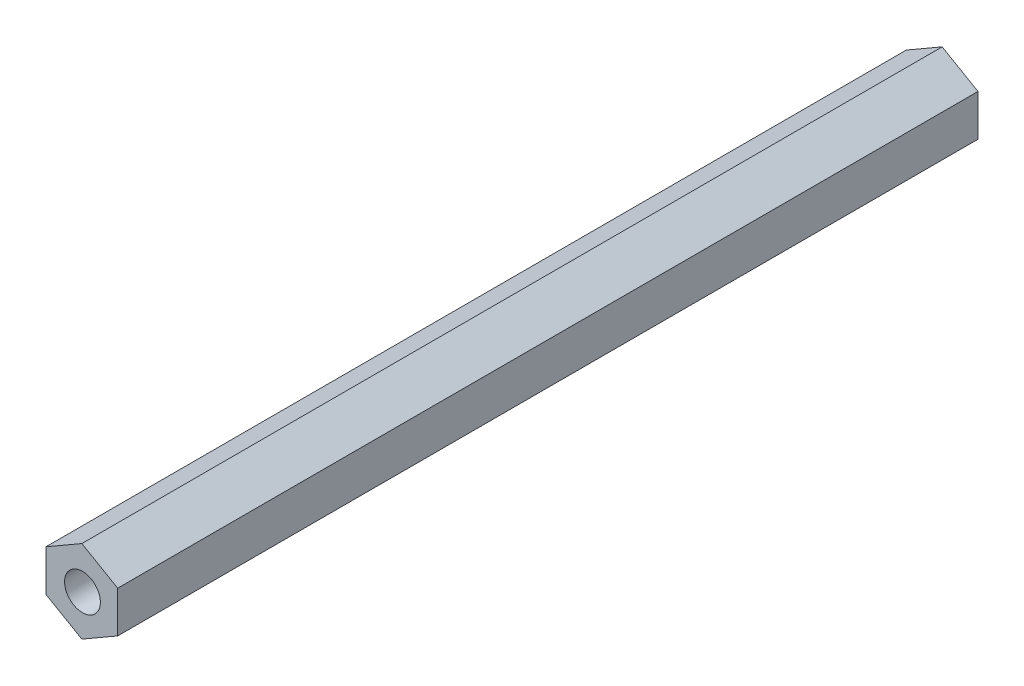
ISO-10303-21;
HEADER;
FILE_DESCRIPTION(('STEP AP214'),'2;1');
FILE_NAME('part.step','',(''),(''),'','','');
FILE_SCHEMA(('AUTOMOTIVE_DESIGN { 1 0 10303 214 1 1 1 1 }'));
ENDSEC;
DATA;
#1=APPLICATION_CONTEXT('core data for automotive mechanical design processes');
#2=APPLICATION_PROTOCOL_DEFINITION('international standard','automotive_design',2000,#1);
#3=PRODUCT_CONTEXT('',#1,'mechanical');
#4=PRODUCT('Part','Part','',(#3));
#5=PRODUCT_RELATED_PRODUCT_CATEGORY('part','',(#4));
#6=PRODUCT_DEFINITION_FORMATION('','',#4);
#7=PRODUCT_DEFINITION_CONTEXT('part definition',#1,'design');
#8=PRODUCT_DEFINITION('design','',#6,#7);
#9=PRODUCT_DEFINITION_SHAPE('','',#8);
#10=(LENGTH_UNIT() NAMED_UNIT(*) SI_UNIT(.MILLI.,.METRE.));
#11=(NAMED_UNIT(*) PLANE_ANGLE_UNIT() SI_UNIT($,.RADIAN.));
#12=(NAMED_UNIT(*) SI_UNIT($,.STERADIAN.) SOLID_ANGLE_UNIT());
#13=UNCERTAINTY_MEASURE_WITH_UNIT(LENGTH_MEASURE(1.E-05),#10,'distance_accuracy_value','');
#14=(GEOMETRIC_REPRESENTATION_CONTEXT(3) GLOBAL_UNCERTAINTY_ASSIGNED_CONTEXT((#13)) GLOBAL_UNIT_ASSIGNED_CONTEXT((#10,
#11,#12)) REPRESENTATION_CONTEXT('',''));
#15=CARTESIAN_POINT('',(0.,0.,0.));
#16=DIRECTION('',(0.,0.,1.));
#17=DIRECTION('',(1.,0.,0.));
#18=AXIS2_PLACEMENT_3D('',#15,#16,#17);
#19=CARTESIAN_POINT('',(0.0438845966641566,-0.0180420660313985,49.9999999998977));
#20=DIRECTION('',(0.,0.,1.));
#21=DIRECTION('',(0.,-1.,0.));
#22=AXIS2_PLACEMENT_3D('',#19,#20,#21);
#23=CONICAL_SURFACE('',#22,1.24999999985675,1.02974425836087);
#24=CARTESIAN_POINT('',(0.0438845966641566,-0.0180420660313985,50.));
#25=DIRECTION('',(0.,0.,-1.));
#26=DIRECTION('',(-1.,0.,0.));
#27=AXIS2_PLACEMENT_3D('',#24,#25,#26);
#28=CIRCLE('',#27,1.24999999999999);
#29=CARTESIAN_POINT('',(-1.20611540333584,-0.0180420660313985,50.));
#30=VERTEX_POINT('',#29);
#31=EDGE_CURVE('E126',#30,#30,#28,.F.);
#32=ORIENTED_EDGE('',*,*,#31,.T.);
#33=EDGE_LOOP('',(#32));
#34=FACE_BOUND('',#33,.T.);
#35=CARTESIAN_POINT('',(0.0438845969199519,-0.0180420660313985,49.2489242260774));
#36=VERTEX_POINT('',#35);
#37=VERTEX_LOOP('',#36);
#38=FACE_BOUND('',#37,.T.);
#39=ADVANCED_FACE('F15',(#34,#38),#23,.F.);
#40=CARTESIAN_POINT('',(0.0438845966641566,-0.0180420660313985,10.0000000000477));
#41=DIRECTION('',(0.,0.,-1.));
#42=DIRECTION('',(-1.,0.,0.));
#43=AXIS2_PLACEMENT_3D('',#40,#41,#42);
#44=CONICAL_SURFACE('',#43,1.24999999985675,1.02974425843443);
#45=CARTESIAN_POINT('',(0.0438845964367829,-0.0180420660313985,10.751075773868));
#46=VERTEX_POINT('',#45);
#47=VERTEX_LOOP('',#46);
#48=FACE_BOUND('',#47,.T.);
#49=CARTESIAN_POINT('',(0.0438845966641566,-0.0180420660313985,10.));
#50=DIRECTION('',(0.,0.,1.));
#51=DIRECTION('',(1.,0.,0.));
#52=AXIS2_PLACEMENT_3D('',#49,#50,#51);
#53=CIRCLE('',#52,1.24999999999999);
#54=CARTESIAN_POINT('',(1.29388459666415,-0.0180420660313985,10.));
#55=VERTEX_POINT('',#54);
#56=EDGE_CURVE('E149',#55,#55,#53,.F.);
#57=ORIENTED_EDGE('',*,*,#56,.T.);
#58=EDGE_LOOP('',(#57));
#59=FACE_BOUND('',#58,.T.);
#60=ADVANCED_FACE('F72',(#48,#59),#44,.F.);
#61=CARTESIAN_POINT('',(0.0438845966641566,-0.0180420660313985,60.));
#62=DIRECTION('',(0.,0.,-1.));
#63=DIRECTION('',(-1.,0.,0.));
#64=AXIS2_PLACEMENT_3D('',#61,#62,#63);
#65=CYLINDRICAL_SURFACE('',#64,1.24999999999999);
#66=ORIENTED_EDGE('',*,*,#31,.F.);
#67=EDGE_LOOP('',(#66));
#68=FACE_BOUND('',#67,.T.);
#69=CARTESIAN_POINT('',(0.0438845966641566,-0.0180420660313985,60.));
#70=DIRECTION('',(0.,0.,-1.));
#71=DIRECTION('',(-1.,0.,0.));
#72=AXIS2_PLACEMENT_3D('',#69,#70,#71);
#73=CIRCLE('',#72,1.24999999999999);
#74=CARTESIAN_POINT('',(-1.20611540333584,-0.0180420660313985,60.));
#75=VERTEX_POINT('',#74);
#76=EDGE_CURVE('E18',#75,#75,#73,.T.);
#77=ORIENTED_EDGE('',*,*,#76,.F.);
#78=EDGE_LOOP('',(#77));
#79=FACE_BOUND('',#78,.T.);
#80=ADVANCED_FACE('F78',(#68,#79),#65,.F.);
#81=CARTESIAN_POINT('',(-2.5,-1.44337567297406,60.));
#82=DIRECTION('',(0.5,0.866025403784439,0.));
#83=DIRECTION('',(-0.866025403784439,0.5,0.));
#84=AXIS2_PLACEMENT_3D('',#81,#82,#83);
#85=PLANE('',#84);
#86=DIRECTION('',(0.,0.,1.));
#87=VECTOR('',#86,1.);
#88=CARTESIAN_POINT('',(0.,-2.88675134594813,60.));
#89=LINE('',#88,#87);
#90=CARTESIAN_POINT('',(0.,-2.88675134594813,0.));
#91=VERTEX_POINT('',#90);
#92=CARTESIAN_POINT('',(0.,-2.88675134594813,60.));
#93=VERTEX_POINT('',#92);
#94=EDGE_CURVE('E153',#91,#93,#89,.T.);
#95=ORIENTED_EDGE('',*,*,#94,.T.);
#96=DIRECTION('',(0.866025403784439,-0.5,0.));
#97=VECTOR('',#96,1.);
#98=CARTESIAN_POINT('',(-2.5,-1.44337567297406,60.));
#99=LINE('',#98,#97);
#100=CARTESIAN_POINT('',(-2.5,-1.44337567297406,60.));
#101=VERTEX_POINT('',#100);
#102=EDGE_CURVE('E140',#101,#93,#99,.T.);
#103=ORIENTED_EDGE('',*,*,#102,.F.);
#104=DIRECTION('',(0.,0.,-1.));
#105=VECTOR('',#104,1.);
#106=CARTESIAN_POINT('',(-2.5,-1.44337567297406,60.));
#107=LINE('',#106,#105);
#108=CARTESIAN_POINT('',(-2.5,-1.44337567297406,0.));
#109=VERTEX_POINT('',#108);
#110=EDGE_CURVE('E132',#101,#109,#107,.T.);
#111=ORIENTED_EDGE('',*,*,#110,.T.);
#112=DIRECTION('',(0.866025403784439,-0.5,0.));
#113=VECTOR('',#112,1.);
#114=CARTESIAN_POINT('',(-2.5,-1.44337567297406,0.));
#115=LINE('',#114,#113);
#116=EDGE_CURVE('E177',#109,#91,#115,.T.);
#117=ORIENTED_EDGE('',*,*,#116,.T.);
#118=EDGE_LOOP('',(#95,#103,#111,#117));
#119=FACE_BOUND('',#118,.T.);
#120=ADVANCED_FACE('F115',(#119),#85,.F.);
#121=CARTESIAN_POINT('',(0.,-2.88675134594813,60.));
#122=DIRECTION('',(-0.5,0.866025403784439,0.));
#123=DIRECTION('',(-0.866025403784439,-0.5,0.));
#124=AXIS2_PLACEMENT_3D('',#121,#122,#123);
#125=PLANE('',#124);
#126=DIRECTION('',(0.,0.,1.));
#127=VECTOR('',#126,1.);
#128=CARTESIAN_POINT('',(2.5,-1.44337567297407,60.));
#129=LINE('',#128,#127);
#130=CARTESIAN_POINT('',(2.5,-1.44337567297407,0.));
#131=VERTEX_POINT('',#130);
#132=CARTESIAN_POINT('',(2.5,-1.44337567297407,60.));
#133=VERTEX_POINT('',#132);
#134=EDGE_CURVE('E150',#131,#133,#129,.T.);
#135=ORIENTED_EDGE('',*,*,#134,.T.);
#136=DIRECTION('',(0.866025403784439,0.499999999999999,0.));
#137=VECTOR('',#136,1.);
#138=CARTESIAN_POINT('',(0.,-2.88675134594813,60.));
#139=LINE('',#138,#137);
#140=EDGE_CURVE('E135',#93,#133,#139,.T.);
#141=ORIENTED_EDGE('',*,*,#140,.F.);
#142=ORIENTED_EDGE('',*,*,#94,.F.);
#143=DIRECTION('',(0.866025403784439,0.499999999999999,0.));
#144=VECTOR('',#143,1.);
#145=CARTESIAN_POINT('',(0.,-2.88675134594813,0.));
#146=LINE('',#145,#144);
#147=EDGE_CURVE('E171',#91,#131,#146,.T.);
#148=ORIENTED_EDGE('',*,*,#147,.T.);
#149=EDGE_LOOP('',(#135,#141,#142,#148));
#150=FACE_BOUND('',#149,.T.);
#151=ADVANCED_FACE('F111',(#150),#125,.F.);
#152=CARTESIAN_POINT('',(2.5,-1.44337567297407,60.));
#153=DIRECTION('',(-1.,0.,0.));
#154=DIRECTION('',(0.,-1.,0.));
#155=AXIS2_PLACEMENT_3D('',#152,#153,#154);
#156=PLANE('',#155);
#157=DIRECTION('',(0.,0.,1.));
#158=VECTOR('',#157,1.);
#159=CARTESIAN_POINT('',(2.5,1.44337567297407,60.));
#160=LINE('',#159,#158);
#161=CARTESIAN_POINT('',(2.5,1.44337567297407,0.));
#162=VERTEX_POINT('',#161);
#163=CARTESIAN_POINT('',(2.5,1.44337567297407,60.));
#164=VERTEX_POINT('',#163);
#165=EDGE_CURVE('E147',#162,#164,#160,.T.);
#166=ORIENTED_EDGE('',*,*,#165,.T.);
#167=DIRECTION('',(0.,1.,0.));
#168=VECTOR('',#167,1.);
#169=CARTESIAN_POINT('',(2.5,4.3301270189222,60.));
#170=LINE('',#169,#168);
#171=EDGE_CURVE('E130',#133,#164,#170,.T.);
#172=ORIENTED_EDGE('',*,*,#171,.F.);
#173=ORIENTED_EDGE('',*,*,#134,.F.);
#174=DIRECTION('',(0.,1.,0.));
#175=VECTOR('',#174,1.);
#176=CARTESIAN_POINT('',(2.5,4.3301270189222,0.));
#177=LINE('',#176,#175);
#178=EDGE_CURVE('E167',#131,#162,#177,.T.);
#179=ORIENTED_EDGE('',*,*,#178,.T.);
#180=EDGE_LOOP('',(#166,#172,#173,#179));
#181=FACE_BOUND('',#180,.T.);
#182=ADVANCED_FACE('F107',(#181),#156,.F.);
#183=CARTESIAN_POINT('',(0.0438845966641566,-0.0180420660313985,0.));
#184=DIRECTION('',(0.,0.,1.));
#185=DIRECTION('',(1.,0.,0.));
#186=AXIS2_PLACEMENT_3D('',#183,#184,#185);
#187=CYLINDRICAL_SURFACE('',#186,1.24999999999999);
#188=CARTESIAN_POINT('',(0.0438845966641566,-0.0180420660313985,0.));
#189=DIRECTION('',(0.,0.,1.));
#190=DIRECTION('',(1.,0.,0.));
#191=AXIS2_PLACEMENT_3D('',#188,#189,#190);
#192=CIRCLE('',#191,1.24999999999999);
#193=CARTESIAN_POINT('',(1.29388459666415,-0.0180420660313985,0.));
#194=VERTEX_POINT('',#193);
#195=EDGE_CURVE('E158',#194,#194,#192,.F.);
#196=ORIENTED_EDGE('',*,*,#195,.T.);
#197=EDGE_LOOP('',(#196));
#198=FACE_BOUND('',#197,.T.);
#199=ORIENTED_EDGE('',*,*,#56,.F.);
#200=EDGE_LOOP('',(#199));
#201=FACE_BOUND('',#200,.T.);
#202=ADVANCED_FACE('F103',(#198,#201),#187,.F.);
#203=CARTESIAN_POINT('',(2.5,1.44337567297407,60.));
#204=DIRECTION('',(-0.5,-0.866025403784439,0.));
#205=DIRECTION('',(0.866025403784439,-0.5,0.));
#206=AXIS2_PLACEMENT_3D('',#203,#204,#205);
#207=PLANE('',#206);
#208=DIRECTION('',(0.,0.,1.));
#209=VECTOR('',#208,1.);
#210=CARTESIAN_POINT('',(0.,2.88675134594813,60.));
#211=LINE('',#210,#209);
#212=CARTESIAN_POINT('',(0.,2.88675134594813,0.));
#213=VERTEX_POINT('',#212);
#214=CARTESIAN_POINT('',(0.,2.88675134594813,60.));
#215=VERTEX_POINT('',#214);
#216=EDGE_CURVE('E160',#213,#215,#211,.T.);
#217=ORIENTED_EDGE('',*,*,#216,.T.);
#218=DIRECTION('',(-0.866025403784439,0.5,0.));
#219=VECTOR('',#218,1.);
#220=CARTESIAN_POINT('',(2.5,1.44337567297407,60.));
#221=LINE('',#220,#219);
#222=EDGE_CURVE('E145',#164,#215,#221,.T.);
#223=ORIENTED_EDGE('',*,*,#222,.F.);
#224=ORIENTED_EDGE('',*,*,#165,.F.);
#225=DIRECTION('',(-0.866025403784439,0.5,0.));
#226=VECTOR('',#225,1.);
#227=CARTESIAN_POINT('',(2.5,1.44337567297407,0.));
#228=LINE('',#227,#226);
#229=EDGE_CURVE('E161',#162,#213,#228,.T.);
#230=ORIENTED_EDGE('',*,*,#229,.T.);
#231=EDGE_LOOP('',(#217,#223,#224,#230));
#232=FACE_BOUND('',#231,.T.);
#233=ADVANCED_FACE('F99',(#232),#207,.F.);
#234=CARTESIAN_POINT('',(-2.5,4.3301270189222,60.));
#235=DIRECTION('',(0.,0.,1.));
#236=DIRECTION('',(1.,0.,0.));
#237=AXIS2_PLACEMENT_3D('',#234,#235,#236);
#238=PLANE('',#237);
#239=ORIENTED_EDGE('',*,*,#76,.T.);
#240=EDGE_LOOP('',(#239));
#241=FACE_BOUND('',#240,.T.);
#242=ORIENTED_EDGE('',*,*,#140,.T.);
#243=ORIENTED_EDGE('',*,*,#171,.T.);
#244=ORIENTED_EDGE('',*,*,#222,.T.);
#245=DIRECTION('',(0.866025403784439,0.5,0.));
#246=VECTOR('',#245,1.);
#247=CARTESIAN_POINT('',(0.,2.88675134594813,60.));
#248=LINE('',#247,#246);
#249=CARTESIAN_POINT('',(-2.5,1.44337567297407,60.));
#250=VERTEX_POINT('',#249);
#251=EDGE_CURVE('E164',#215,#250,#248,.F.);
#252=ORIENTED_EDGE('',*,*,#251,.T.);
#253=DIRECTION('',(0.,1.,0.));
#254=VECTOR('',#253,1.);
#255=CARTESIAN_POINT('',(-2.5,1.44337567297407,60.));
#256=LINE('',#255,#254);
#257=EDGE_CURVE('E129',#250,#101,#256,.F.);
#258=ORIENTED_EDGE('',*,*,#257,.T.);
#259=ORIENTED_EDGE('',*,*,#102,.T.);
#260=EDGE_LOOP('',(#242,#243,#244,#252,#258,#259));
#261=FACE_BOUND('',#260,.T.);
#262=ADVANCED_FACE('F95',(#241,#261),#238,.T.);
#263=CARTESIAN_POINT('',(-2.5,1.44337567297407,60.));
#264=DIRECTION('',(1.,0.,0.));
#265=DIRECTION('',(0.,0.,-1.));
#266=AXIS2_PLACEMENT_3D('',#263,#264,#265);
#267=PLANE('',#266);
#268=ORIENTED_EDGE('',*,*,#110,.F.);
#269=ORIENTED_EDGE('',*,*,#257,.F.);
#270=DIRECTION('',(0.,0.,1.));
#271=VECTOR('',#270,1.);
#272=CARTESIAN_POINT('',(-2.5,1.44337567297406,60.));
#273=LINE('',#272,#271);
#274=CARTESIAN_POINT('',(-2.5,1.44337567297407,0.));
#275=VERTEX_POINT('',#274);
#276=EDGE_CURVE('E24',#250,#275,#273,.F.);
#277=ORIENTED_EDGE('',*,*,#276,.T.);
#278=DIRECTION('',(0.,1.,0.));
#279=VECTOR('',#278,1.);
#280=CARTESIAN_POINT('',(-2.5,4.3301270189222,0.));
#281=LINE('',#280,#279);
#282=EDGE_CURVE('E32',#275,#109,#281,.F.);
#283=ORIENTED_EDGE('',*,*,#282,.T.);
#284=EDGE_LOOP('',(#268,#269,#277,#283));
#285=FACE_BOUND('',#284,.T.);
#286=ADVANCED_FACE('F88',(#285),#267,.F.);
#287=CARTESIAN_POINT('',(-2.5,4.3301270189222,0.));
#288=DIRECTION('',(0.,0.,1.));
#289=DIRECTION('',(1.,0.,0.));
#290=AXIS2_PLACEMENT_3D('',#287,#288,#289);
#291=PLANE('',#290);
#292=ORIENTED_EDGE('',*,*,#195,.F.);
#293=EDGE_LOOP('',(#292));
#294=FACE_BOUND('',#293,.T.);
#295=ORIENTED_EDGE('',*,*,#178,.F.);
#296=ORIENTED_EDGE('',*,*,#147,.F.);
#297=ORIENTED_EDGE('',*,*,#116,.F.);
#298=ORIENTED_EDGE('',*,*,#282,.F.);
#299=DIRECTION('',(0.866025403784439,0.5,0.));
#300=VECTOR('',#299,1.);
#301=CARTESIAN_POINT('',(0.,2.88675134594813,0.));
#302=LINE('',#301,#300);
#303=EDGE_CURVE('E10',#275,#213,#302,.T.);
#304=ORIENTED_EDGE('',*,*,#303,.T.);
#305=ORIENTED_EDGE('',*,*,#229,.F.);
#306=EDGE_LOOP('',(#295,#296,#297,#298,#304,#305));
#307=FACE_BOUND('',#306,.T.);
#308=ADVANCED_FACE('F82',(#294,#307),#291,.F.);
#309=CARTESIAN_POINT('',(0.,2.88675134594813,60.));
#310=DIRECTION('',(0.5,-0.866025403784439,0.));
#311=DIRECTION('',(0.866025403784439,0.5,0.));
#312=AXIS2_PLACEMENT_3D('',#309,#310,#311);
#313=PLANE('',#312);
#314=ORIENTED_EDGE('',*,*,#276,.F.);
#315=ORIENTED_EDGE('',*,*,#251,.F.);
#316=ORIENTED_EDGE('',*,*,#216,.F.);
#317=ORIENTED_EDGE('',*,*,#303,.F.);
#318=EDGE_LOOP('',(#314,#315,#316,#317));
#319=FACE_BOUND('',#318,.T.);
#320=ADVANCED_FACE('F80',(#319),#313,.F.);
#321=CLOSED_SHELL('',(#39,#60,#80,#120,#151,#182,#202,#233,#262,#286,#308,#320));
#322=MANIFOLD_SOLID_BREP('B1',#321);
#323=ADVANCED_BREP_SHAPE_REPRESENTATION('',(#18,#322),#14);
#324=SHAPE_DEFINITION_REPRESENTATION(#9,#323);
ENDSEC;
END-ISO-10303-21;
